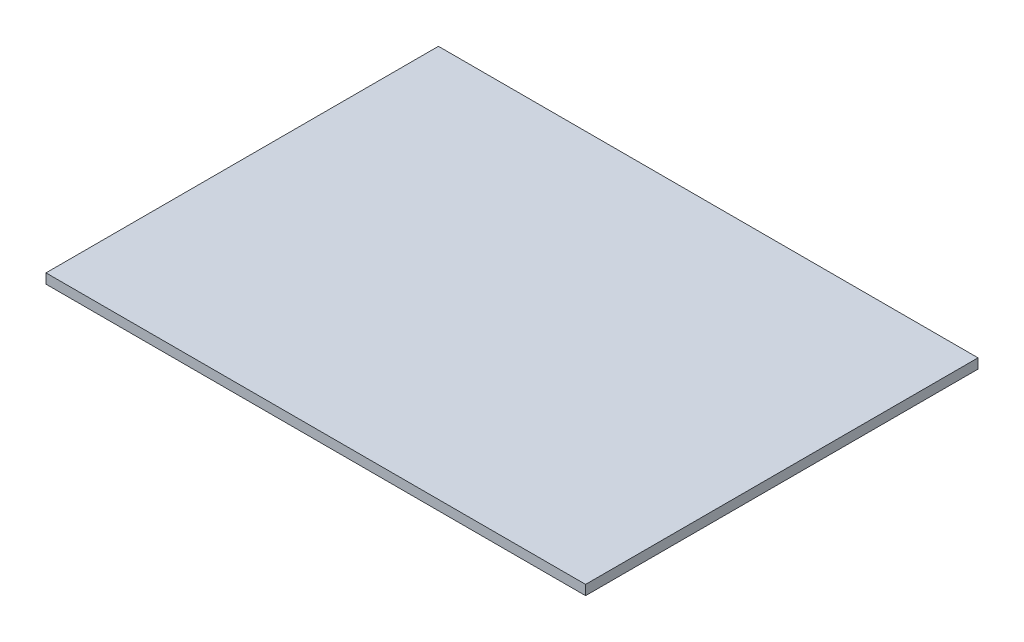
ISO-10303-21;
HEADER;
FILE_DESCRIPTION(('STEP AP214'),'2;1');
FILE_NAME('part.step','',(''),(''),'','','');
FILE_SCHEMA(('AUTOMOTIVE_DESIGN { 1 0 10303 214 1 1 1 1 }'));
ENDSEC;
DATA;
#1=APPLICATION_CONTEXT('core data for automotive mechanical design processes');
#2=APPLICATION_PROTOCOL_DEFINITION('international standard','automotive_design',2000,#1);
#3=PRODUCT_CONTEXT('',#1,'mechanical');
#4=PRODUCT('Part','Part','',(#3));
#5=PRODUCT_RELATED_PRODUCT_CATEGORY('part','',(#4));
#6=PRODUCT_DEFINITION_FORMATION('','',#4);
#7=PRODUCT_DEFINITION_CONTEXT('part definition',#1,'design');
#8=PRODUCT_DEFINITION('design','',#6,#7);
#9=PRODUCT_DEFINITION_SHAPE('','',#8);
#10=(LENGTH_UNIT() NAMED_UNIT(*) SI_UNIT(.MILLI.,.METRE.));
#11=(NAMED_UNIT(*) PLANE_ANGLE_UNIT() SI_UNIT($,.RADIAN.));
#12=(NAMED_UNIT(*) SI_UNIT($,.STERADIAN.) SOLID_ANGLE_UNIT());
#13=UNCERTAINTY_MEASURE_WITH_UNIT(LENGTH_MEASURE(1.E-05),#10,'distance_accuracy_value','');
#14=(GEOMETRIC_REPRESENTATION_CONTEXT(3) GLOBAL_UNCERTAINTY_ASSIGNED_CONTEXT((#13)) GLOBAL_UNIT_ASSIGNED_CONTEXT((#10,
#11,#12)) REPRESENTATION_CONTEXT('',''));
#15=CARTESIAN_POINT('',(0.,0.,0.));
#16=DIRECTION('',(0.,0.,1.));
#17=DIRECTION('',(1.,0.,0.));
#18=AXIS2_PLACEMENT_3D('',#15,#16,#17);
#19=CARTESIAN_POINT('',(425.,15.,300.));
#20=DIRECTION('',(0.,0.,1.));
#21=DIRECTION('',(1.,0.,0.));
#22=AXIS2_PLACEMENT_3D('',#19,#20,#21);
#23=PLANE('',#22);
#24=DIRECTION('',(-1.,0.,0.));
#25=VECTOR('',#24,1.);
#26=CARTESIAN_POINT('',(425.,0.,300.));
#27=LINE('',#26,#25);
#28=CARTESIAN_POINT('',(425.,0.,300.));
#29=VERTEX_POINT('',#28);
#30=CARTESIAN_POINT('',(-400.,0.,300.));
#31=VERTEX_POINT('',#30);
#32=EDGE_CURVE('E99',#29,#31,#27,.T.);
#33=ORIENTED_EDGE('',*,*,#32,.F.);
#34=DIRECTION('',(0.,-1.,0.));
#35=VECTOR('',#34,1.);
#36=CARTESIAN_POINT('',(425.,15.,300.));
#37=LINE('',#36,#35);
#38=CARTESIAN_POINT('',(425.,15.,300.));
#39=VERTEX_POINT('',#38);
#40=EDGE_CURVE('E11',#39,#29,#37,.T.);
#41=ORIENTED_EDGE('',*,*,#40,.F.);
#42=DIRECTION('',(-1.,0.,0.));
#43=VECTOR('',#42,1.);
#44=CARTESIAN_POINT('',(425.,15.,300.));
#45=LINE('',#44,#43);
#46=CARTESIAN_POINT('',(-400.,15.,300.));
#47=VERTEX_POINT('',#46);
#48=EDGE_CURVE('E93',#39,#47,#45,.T.);
#49=ORIENTED_EDGE('',*,*,#48,.T.);
#50=DIRECTION('',(0.,-1.,0.));
#51=VECTOR('',#50,1.);
#52=CARTESIAN_POINT('',(-400.,15.,300.));
#53=LINE('',#52,#51);
#54=EDGE_CURVE('E38',#47,#31,#53,.T.);
#55=ORIENTED_EDGE('',*,*,#54,.T.);
#56=EDGE_LOOP('',(#33,#41,#49,#55));
#57=FACE_BOUND('',#56,.T.);
#58=ADVANCED_FACE('F35',(#57),#23,.T.);
#59=CARTESIAN_POINT('',(425.,15.,-300.));
#60=DIRECTION('',(1.,0.,0.));
#61=DIRECTION('',(0.,0.,-1.));
#62=AXIS2_PLACEMENT_3D('',#59,#60,#61);
#63=PLANE('',#62);
#64=DIRECTION('',(0.,0.,1.));
#65=VECTOR('',#64,1.);
#66=CARTESIAN_POINT('',(425.,0.,-300.));
#67=LINE('',#66,#65);
#68=CARTESIAN_POINT('',(425.,0.,-300.));
#69=VERTEX_POINT('',#68);
#70=EDGE_CURVE('E95',#69,#29,#67,.T.);
#71=ORIENTED_EDGE('',*,*,#70,.F.);
#72=DIRECTION('',(0.,-1.,0.));
#73=VECTOR('',#72,1.);
#74=CARTESIAN_POINT('',(425.,15.,-300.));
#75=LINE('',#74,#73);
#76=CARTESIAN_POINT('',(425.,15.,-300.));
#77=VERTEX_POINT('',#76);
#78=EDGE_CURVE('E44',#77,#69,#75,.T.);
#79=ORIENTED_EDGE('',*,*,#78,.F.);
#80=DIRECTION('',(0.,0.,1.));
#81=VECTOR('',#80,1.);
#82=CARTESIAN_POINT('',(425.,15.,-300.));
#83=LINE('',#82,#81);
#84=EDGE_CURVE('E90',#77,#39,#83,.T.);
#85=ORIENTED_EDGE('',*,*,#84,.T.);
#86=ORIENTED_EDGE('',*,*,#40,.T.);
#87=EDGE_LOOP('',(#71,#79,#85,#86));
#88=FACE_BOUND('',#87,.T.);
#89=ADVANCED_FACE('F109',(#88),#63,.T.);
#90=CARTESIAN_POINT('',(-400.,15.,-300.));
#91=DIRECTION('',(0.,0.,-1.));
#92=DIRECTION('',(-1.,0.,0.));
#93=AXIS2_PLACEMENT_3D('',#90,#91,#92);
#94=PLANE('',#93);
#95=DIRECTION('',(1.,0.,0.));
#96=VECTOR('',#95,1.);
#97=CARTESIAN_POINT('',(-400.,0.,-300.));
#98=LINE('',#97,#96);
#99=CARTESIAN_POINT('',(-400.,0.,-300.));
#100=VERTEX_POINT('',#99);
#101=EDGE_CURVE('E85',#100,#69,#98,.T.);
#102=ORIENTED_EDGE('',*,*,#101,.F.);
#103=DIRECTION('',(0.,-1.,0.));
#104=VECTOR('',#103,1.);
#105=CARTESIAN_POINT('',(-400.,15.,-300.));
#106=LINE('',#105,#104);
#107=CARTESIAN_POINT('',(-400.,15.,-300.));
#108=VERTEX_POINT('',#107);
#109=EDGE_CURVE('E80',#108,#100,#106,.T.);
#110=ORIENTED_EDGE('',*,*,#109,.F.);
#111=DIRECTION('',(1.,0.,0.));
#112=VECTOR('',#111,1.);
#113=CARTESIAN_POINT('',(-400.,15.,-300.));
#114=LINE('',#113,#112);
#115=EDGE_CURVE('E83',#108,#77,#114,.T.);
#116=ORIENTED_EDGE('',*,*,#115,.T.);
#117=ORIENTED_EDGE('',*,*,#78,.T.);
#118=EDGE_LOOP('',(#102,#110,#116,#117));
#119=FACE_BOUND('',#118,.T.);
#120=ADVANCED_FACE('F82',(#119),#94,.T.);
#121=CARTESIAN_POINT('',(-400.,15.,300.));
#122=DIRECTION('',(-1.,0.,0.));
#123=DIRECTION('',(0.,0.,1.));
#124=AXIS2_PLACEMENT_3D('',#121,#122,#123);
#125=PLANE('',#124);
#126=DIRECTION('',(0.,0.,-1.));
#127=VECTOR('',#126,1.);
#128=CARTESIAN_POINT('',(-400.,0.,300.));
#129=LINE('',#128,#127);
#130=EDGE_CURVE('E102',#31,#100,#129,.T.);
#131=ORIENTED_EDGE('',*,*,#130,.F.);
#132=ORIENTED_EDGE('',*,*,#54,.F.);
#133=DIRECTION('',(0.,0.,-1.));
#134=VECTOR('',#133,1.);
#135=CARTESIAN_POINT('',(-400.,15.,300.));
#136=LINE('',#135,#134);
#137=EDGE_CURVE('E89',#47,#108,#136,.T.);
#138=ORIENTED_EDGE('',*,*,#137,.T.);
#139=ORIENTED_EDGE('',*,*,#109,.T.);
#140=EDGE_LOOP('',(#131,#132,#138,#139));
#141=FACE_BOUND('',#140,.T.);
#142=ADVANCED_FACE('F92',(#141),#125,.T.);
#143=CARTESIAN_POINT('',(0.,15.,0.));
#144=DIRECTION('',(0.,-1.,0.));
#145=DIRECTION('',(0.,0.,-1.));
#146=AXIS2_PLACEMENT_3D('',#143,#144,#145);
#147=PLANE('',#146);
#148=ORIENTED_EDGE('',*,*,#48,.F.);
#149=ORIENTED_EDGE('',*,*,#84,.F.);
#150=ORIENTED_EDGE('',*,*,#115,.F.);
#151=ORIENTED_EDGE('',*,*,#137,.F.);
#152=EDGE_LOOP('',(#148,#149,#150,#151));
#153=FACE_BOUND('',#152,.T.);
#154=ADVANCED_FACE('F88',(#153),#147,.F.);
#155=CARTESIAN_POINT('',(0.,0.,0.));
#156=DIRECTION('',(0.,-1.,0.));
#157=DIRECTION('',(0.,0.,-1.));
#158=AXIS2_PLACEMENT_3D('',#155,#156,#157);
#159=PLANE('',#158);
#160=ORIENTED_EDGE('',*,*,#32,.T.);
#161=ORIENTED_EDGE('',*,*,#130,.T.);
#162=ORIENTED_EDGE('',*,*,#101,.T.);
#163=ORIENTED_EDGE('',*,*,#70,.T.);
#164=EDGE_LOOP('',(#160,#161,#162,#163));
#165=FACE_BOUND('',#164,.T.);
#166=ADVANCED_FACE('F108',(#165),#159,.T.);
#167=CLOSED_SHELL('',(#58,#89,#120,#142,#154,#166));
#168=MANIFOLD_SOLID_BREP('B2',#167);
#169=ADVANCED_BREP_SHAPE_REPRESENTATION('',(#18,#168),#14);
#170=SHAPE_DEFINITION_REPRESENTATION(#9,#169);
ENDSEC;
END-ISO-10303-21;
